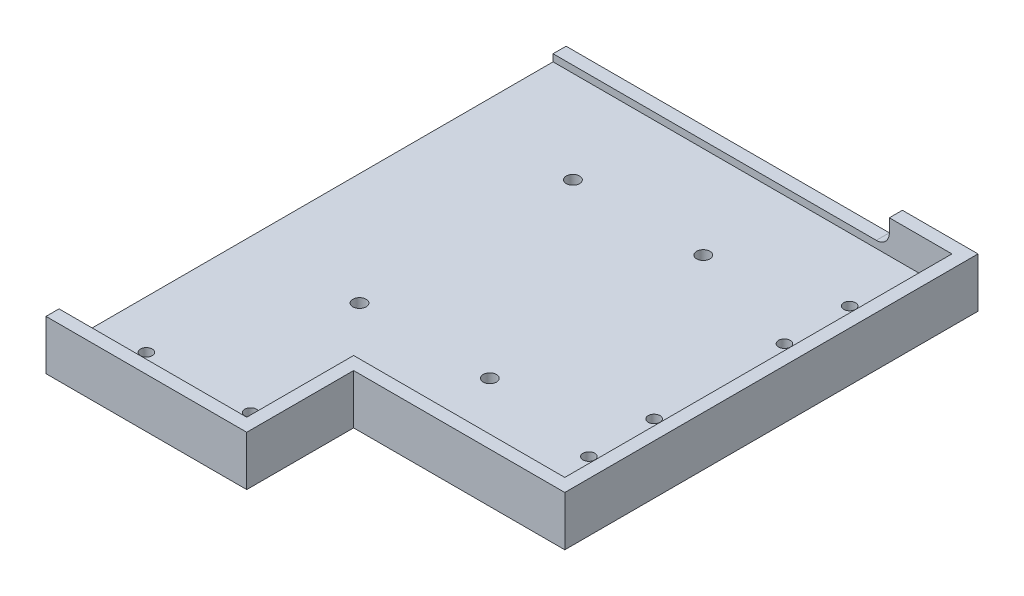
ISO-10303-21;
HEADER;
FILE_DESCRIPTION(('STEP AP214'),'2;1');
FILE_NAME('part.step','',(''),(''),'','','');
FILE_SCHEMA(('AUTOMOTIVE_DESIGN { 1 0 10303 214 1 1 1 1 }'));
ENDSEC;
DATA;
#1=APPLICATION_CONTEXT('core data for automotive mechanical design processes');
#2=APPLICATION_PROTOCOL_DEFINITION('international standard','automotive_design',2000,#1);
#3=PRODUCT_CONTEXT('',#1,'mechanical');
#4=PRODUCT('Part','Part','',(#3));
#5=PRODUCT_RELATED_PRODUCT_CATEGORY('part','',(#4));
#6=PRODUCT_DEFINITION_FORMATION('','',#4);
#7=PRODUCT_DEFINITION_CONTEXT('part definition',#1,'design');
#8=PRODUCT_DEFINITION('design','',#6,#7);
#9=PRODUCT_DEFINITION_SHAPE('','',#8);
#10=(LENGTH_UNIT() NAMED_UNIT(*) SI_UNIT(.MILLI.,.METRE.));
#11=(NAMED_UNIT(*) PLANE_ANGLE_UNIT() SI_UNIT($,.RADIAN.));
#12=(NAMED_UNIT(*) SI_UNIT($,.STERADIAN.) SOLID_ANGLE_UNIT());
#13=UNCERTAINTY_MEASURE_WITH_UNIT(LENGTH_MEASURE(1.E-05),#10,'distance_accuracy_value','');
#14=(GEOMETRIC_REPRESENTATION_CONTEXT(3) GLOBAL_UNCERTAINTY_ASSIGNED_CONTEXT((#13)) GLOBAL_UNIT_ASSIGNED_CONTEXT((#10,
#11,#12)) REPRESENTATION_CONTEXT('',''));
#15=CARTESIAN_POINT('',(0.,0.,0.));
#16=DIRECTION('',(0.,0.,1.));
#17=DIRECTION('',(1.,0.,0.));
#18=AXIS2_PLACEMENT_3D('',#15,#16,#17);
#19=CARTESIAN_POINT('',(0.,0.,0.));
#20=DIRECTION('',(0.,1.,0.));
#21=DIRECTION('',(0.,0.,1.));
#22=AXIS2_PLACEMENT_3D('',#19,#20,#21);
#23=PLANE('',#22);
#24=CARTESIAN_POINT('',(43.,0.,122.25));
#25=DIRECTION('',(0.,1.,0.));
#26=DIRECTION('',(0.,0.,1.));
#27=AXIS2_PLACEMENT_3D('',#24,#25,#26);
#28=CIRCLE('',#27,2.55);
#29=CARTESIAN_POINT('',(43.,0.,124.8));
#30=VERTEX_POINT('',#29);
#31=EDGE_CURVE('E721',#30,#30,#28,.T.);
#32=ORIENTED_EDGE('',*,*,#31,.T.);
#33=EDGE_LOOP('',(#32));
#34=FACE_BOUND('',#33,.T.);
#35=CARTESIAN_POINT('',(93.,0.,122.25));
#36=DIRECTION('',(0.,1.,0.));
#37=DIRECTION('',(0.,0.,1.));
#38=AXIS2_PLACEMENT_3D('',#35,#36,#37);
#39=CIRCLE('',#38,2.55);
#40=CARTESIAN_POINT('',(93.,0.,124.8));
#41=VERTEX_POINT('',#40);
#42=EDGE_CURVE('E713',#41,#41,#39,.T.);
#43=ORIENTED_EDGE('',*,*,#42,.T.);
#44=EDGE_LOOP('',(#43));
#45=FACE_BOUND('',#44,.T.);
#46=CARTESIAN_POINT('',(93.,0.,40.38));
#47=DIRECTION('',(0.,1.,0.));
#48=DIRECTION('',(0.,0.,1.));
#49=AXIS2_PLACEMENT_3D('',#46,#47,#48);
#50=CIRCLE('',#49,2.55);
#51=CARTESIAN_POINT('',(93.,0.,42.93));
#52=VERTEX_POINT('',#51);
#53=EDGE_CURVE('E705',#52,#52,#50,.T.);
#54=ORIENTED_EDGE('',*,*,#53,.T.);
#55=EDGE_LOOP('',(#54));
#56=FACE_BOUND('',#55,.T.);
#57=CARTESIAN_POINT('',(43.,0.,40.38));
#58=DIRECTION('',(0.,1.,0.));
#59=DIRECTION('',(0.,0.,1.));
#60=AXIS2_PLACEMENT_3D('',#57,#58,#59);
#61=CIRCLE('',#60,2.55);
#62=CARTESIAN_POINT('',(43.,0.,42.93));
#63=VERTEX_POINT('',#62);
#64=EDGE_CURVE('E685',#63,#63,#61,.T.);
#65=ORIENTED_EDGE('',*,*,#64,.T.);
#66=EDGE_LOOP('',(#65));
#67=FACE_BOUND('',#66,.T.);
#68=CARTESIAN_POINT('',(138.,0.,129.25));
#69=DIRECTION('',(0.,-1.,0.));
#70=DIRECTION('',(0.,0.,-1.));
#71=AXIS2_PLACEMENT_3D('',#68,#69,#70);
#72=CIRCLE('',#71,2.25);
#73=CARTESIAN_POINT('',(138.,0.,127.));
#74=VERTEX_POINT('',#73);
#75=EDGE_CURVE('E280',#74,#74,#72,.T.);
#76=ORIENTED_EDGE('',*,*,#75,.F.);
#77=EDGE_LOOP('',(#76));
#78=FACE_BOUND('',#77,.T.);
#79=CARTESIAN_POINT('',(138.,0.,54.25));
#80=DIRECTION('',(0.,-1.,0.));
#81=DIRECTION('',(0.,0.,-1.));
#82=AXIS2_PLACEMENT_3D('',#79,#80,#81);
#83=CIRCLE('',#82,2.25);
#84=CARTESIAN_POINT('',(138.,0.,52.));
#85=VERTEX_POINT('',#84);
#86=EDGE_CURVE('E300',#85,#85,#83,.T.);
#87=ORIENTED_EDGE('',*,*,#86,.F.);
#88=EDGE_LOOP('',(#87));
#89=FACE_BOUND('',#88,.T.);
#90=DIRECTION('',(-1.,0.,0.));
#91=VECTOR('',#90,1.);
#92=CARTESIAN_POINT('',(158.,0.,158.5));
#93=LINE('',#92,#91);
#94=CARTESIAN_POINT('',(158.,0.,158.5));
#95=VERTEX_POINT('',#94);
#96=CARTESIAN_POINT('',(77.0000000000001,0.,158.5));
#97=VERTEX_POINT('',#96);
#98=EDGE_CURVE('E243',#95,#97,#93,.T.);
#99=ORIENTED_EDGE('',*,*,#98,.T.);
#100=DIRECTION('',(0.,0.,1.));
#101=VECTOR('',#100,1.);
#102=CARTESIAN_POINT('',(77.0000000000001,0.,199.5));
#103=LINE('',#102,#101);
#104=CARTESIAN_POINT('',(77.0000000000001,0.,199.5));
#105=VERTEX_POINT('',#104);
#106=EDGE_CURVE('E385',#97,#105,#103,.T.);
#107=ORIENTED_EDGE('',*,*,#106,.T.);
#108=DIRECTION('',(1.,0.,0.));
#109=VECTOR('',#108,1.);
#110=CARTESIAN_POINT('',(0.,0.,199.5));
#111=LINE('',#110,#109);
#112=CARTESIAN_POINT('',(0.,0.,199.5));
#113=VERTEX_POINT('',#112);
#114=EDGE_CURVE('E207',#113,#105,#111,.T.);
#115=ORIENTED_EDGE('',*,*,#114,.F.);
#116=DIRECTION('',(0.,0.,1.));
#117=VECTOR('',#116,1.);
#118=CARTESIAN_POINT('',(0.,0.,0.));
#119=LINE('',#118,#117);
#120=CARTESIAN_POINT('',(0.,0.,0.));
#121=VERTEX_POINT('',#120);
#122=EDGE_CURVE('E212',#121,#113,#119,.T.);
#123=ORIENTED_EDGE('',*,*,#122,.F.);
#124=DIRECTION('',(-1.,0.,0.));
#125=VECTOR('',#124,1.);
#126=CARTESIAN_POINT('',(0.,0.,0.));
#127=LINE('',#126,#125);
#128=CARTESIAN_POINT('',(158.,0.,0.));
#129=VERTEX_POINT('',#128);
#130=EDGE_CURVE('E175',#129,#121,#127,.T.);
#131=ORIENTED_EDGE('',*,*,#130,.F.);
#132=DIRECTION('',(0.,0.,-1.));
#133=VECTOR('',#132,1.);
#134=CARTESIAN_POINT('',(158.,0.,0.));
#135=LINE('',#134,#133);
#136=EDGE_CURVE('E220',#95,#129,#135,.T.);
#137=ORIENTED_EDGE('',*,*,#136,.F.);
#138=EDGE_LOOP('',(#99,#107,#115,#123,#131,#137));
#139=FACE_BOUND('',#138,.T.);
#140=CARTESIAN_POINT('',(138.,0.,29.25));
#141=DIRECTION('',(0.,-1.,0.));
#142=DIRECTION('',(0.,0.,-1.));
#143=AXIS2_PLACEMENT_3D('',#140,#141,#142);
#144=CIRCLE('',#143,2.25);
#145=CARTESIAN_POINT('',(138.,0.,27.));
#146=VERTEX_POINT('',#145);
#147=EDGE_CURVE('E250',#146,#146,#144,.T.);
#148=ORIENTED_EDGE('',*,*,#147,.F.);
#149=EDGE_LOOP('',(#148));
#150=FACE_BOUND('',#149,.T.);
#151=CARTESIAN_POINT('',(138.,0.,104.25));
#152=DIRECTION('',(0.,-1.,0.));
#153=DIRECTION('',(0.,0.,-1.));
#154=AXIS2_PLACEMENT_3D('',#151,#152,#153);
#155=CIRCLE('',#154,2.25);
#156=CARTESIAN_POINT('',(138.,0.,102.));
#157=VERTEX_POINT('',#156);
#158=EDGE_CURVE('E254',#157,#157,#155,.T.);
#159=ORIENTED_EDGE('',*,*,#158,.F.);
#160=EDGE_LOOP('',(#159));
#161=FACE_BOUND('',#160,.T.);
#162=CARTESIAN_POINT('',(58.5,0.,179.5));
#163=DIRECTION('',(0.,-1.,0.));
#164=DIRECTION('',(0.,0.,-1.));
#165=AXIS2_PLACEMENT_3D('',#162,#163,#164);
#166=CIRCLE('',#165,2.25);
#167=CARTESIAN_POINT('',(58.5,0.,177.25));
#168=VERTEX_POINT('',#167);
#169=EDGE_CURVE('E258',#168,#168,#166,.T.);
#170=ORIENTED_EDGE('',*,*,#169,.F.);
#171=EDGE_LOOP('',(#170));
#172=FACE_BOUND('',#171,.T.);
#173=CARTESIAN_POINT('',(18.5,0.,179.5));
#174=DIRECTION('',(0.,-1.,0.));
#175=DIRECTION('',(0.,0.,-1.));
#176=AXIS2_PLACEMENT_3D('',#173,#174,#175);
#177=CIRCLE('',#176,2.25);
#178=CARTESIAN_POINT('',(18.5,0.,177.25));
#179=VERTEX_POINT('',#178);
#180=EDGE_CURVE('E261',#179,#179,#177,.T.);
#181=ORIENTED_EDGE('',*,*,#180,.F.);
#182=EDGE_LOOP('',(#181));
#183=FACE_BOUND('',#182,.T.);
#184=ADVANCED_FACE('F43',(#34,#45,#56,#67,#78,#89,#139,#150,#161,#172,#183),#23,.F.);
#185=CARTESIAN_POINT('',(0.,6.35,0.));
#186=DIRECTION('',(1.,0.,0.));
#187=DIRECTION('',(0.,0.,-1.));
#188=AXIS2_PLACEMENT_3D('',#185,#186,#187);
#189=PLANE('',#188);
#190=DIRECTION('',(0.,-1.,0.));
#191=VECTOR('',#190,1.);
#192=CARTESIAN_POINT('',(0.,19.05,5.00000000000002));
#193=LINE('',#192,#191);
#194=CARTESIAN_POINT('',(0.,9.05,5.00000000000003));
#195=VERTEX_POINT('',#194);
#196=CARTESIAN_POINT('',(0.,6.35,5.00000000000002));
#197=VERTEX_POINT('',#196);
#198=EDGE_CURVE('E168',#195,#197,#193,.T.);
#199=ORIENTED_EDGE('',*,*,#198,.F.);
#200=DIRECTION('',(0.,0.,-1.));
#201=VECTOR('',#200,1.);
#202=CARTESIAN_POINT('',(0.,9.05,199.501));
#203=LINE('',#202,#201);
#204=CARTESIAN_POINT('',(0.,9.05,0.));
#205=VERTEX_POINT('',#204);
#206=EDGE_CURVE('E153',#195,#205,#203,.T.);
#207=ORIENTED_EDGE('',*,*,#206,.T.);
#208=DIRECTION('',(0.,-1.,0.));
#209=VECTOR('',#208,1.);
#210=CARTESIAN_POINT('',(0.,6.35,0.));
#211=LINE('',#210,#209);
#212=EDGE_CURVE('E165',#205,#121,#211,.T.);
#213=ORIENTED_EDGE('',*,*,#212,.T.);
#214=ORIENTED_EDGE('',*,*,#122,.T.);
#215=DIRECTION('',(0.,-1.,0.));
#216=VECTOR('',#215,1.);
#217=CARTESIAN_POINT('',(0.,6.35,199.5));
#218=LINE('',#217,#216);
#219=CARTESIAN_POINT('',(0.,19.05,199.5));
#220=VERTEX_POINT('',#219);
#221=EDGE_CURVE('E184',#220,#113,#218,.T.);
#222=ORIENTED_EDGE('',*,*,#221,.F.);
#223=DIRECTION('',(0.,0.,1.));
#224=VECTOR('',#223,1.);
#225=CARTESIAN_POINT('',(0.,19.05,194.5));
#226=LINE('',#225,#224);
#227=CARTESIAN_POINT('',(0.,19.05,194.5));
#228=VERTEX_POINT('',#227);
#229=EDGE_CURVE('E327',#228,#220,#226,.T.);
#230=ORIENTED_EDGE('',*,*,#229,.F.);
#231=DIRECTION('',(0.,-1.,0.));
#232=VECTOR('',#231,1.);
#233=CARTESIAN_POINT('',(0.,19.05,194.5));
#234=LINE('',#233,#232);
#235=CARTESIAN_POINT('',(0.,6.35,194.5));
#236=VERTEX_POINT('',#235);
#237=EDGE_CURVE('E343',#228,#236,#234,.T.);
#238=ORIENTED_EDGE('',*,*,#237,.T.);
#239=DIRECTION('',(0.,0.,1.));
#240=VECTOR('',#239,1.);
#241=CARTESIAN_POINT('',(0.,6.35,0.));
#242=LINE('',#241,#240);
#243=EDGE_CURVE('E179',#197,#236,#242,.T.);
#244=ORIENTED_EDGE('',*,*,#243,.F.);
#245=EDGE_LOOP('',(#199,#207,#213,#214,#222,#230,#238,#244));
#246=FACE_BOUND('',#245,.T.);
#247=ADVANCED_FACE('F163',(#246),#189,.F.);
#248=CARTESIAN_POINT('',(0.,6.35,199.5));
#249=DIRECTION('',(0.,0.,-1.));
#250=DIRECTION('',(-1.,0.,0.));
#251=AXIS2_PLACEMENT_3D('',#248,#249,#250);
#252=PLANE('',#251);
#253=ORIENTED_EDGE('',*,*,#114,.T.);
#254=DIRECTION('',(0.,1.,0.));
#255=VECTOR('',#254,1.);
#256=CARTESIAN_POINT('',(77.0000000000001,0.,199.5));
#257=LINE('',#256,#255);
#258=CARTESIAN_POINT('',(77.0000000000001,19.05,199.5));
#259=VERTEX_POINT('',#258);
#260=EDGE_CURVE('E215',#105,#259,#257,.T.);
#261=ORIENTED_EDGE('',*,*,#260,.T.);
#262=DIRECTION('',(1.,0.,0.));
#263=VECTOR('',#262,1.);
#264=CARTESIAN_POINT('',(0.,19.05,199.5));
#265=LINE('',#264,#263);
#266=EDGE_CURVE('E209',#220,#259,#265,.T.);
#267=ORIENTED_EDGE('',*,*,#266,.F.);
#268=ORIENTED_EDGE('',*,*,#221,.T.);
#269=EDGE_LOOP('',(#253,#261,#267,#268));
#270=FACE_BOUND('',#269,.T.);
#271=ADVANCED_FACE('F206',(#270),#252,.F.);
#272=CARTESIAN_POINT('',(158.,6.35,0.));
#273=DIRECTION('',(-1.,0.,0.));
#274=DIRECTION('',(0.,0.,1.));
#275=AXIS2_PLACEMENT_3D('',#272,#273,#274);
#276=PLANE('',#275);
#277=DIRECTION('',(0.,-1.,0.));
#278=VECTOR('',#277,1.);
#279=CARTESIAN_POINT('',(158.,6.35,0.));
#280=LINE('',#279,#278);
#281=CARTESIAN_POINT('',(158.,19.05,0.));
#282=VERTEX_POINT('',#281);
#283=EDGE_CURVE('E178',#282,#129,#280,.T.);
#284=ORIENTED_EDGE('',*,*,#283,.F.);
#285=DIRECTION('',(0.,0.,-1.));
#286=VECTOR('',#285,1.);
#287=CARTESIAN_POINT('',(158.,19.05,158.5));
#288=LINE('',#287,#286);
#289=CARTESIAN_POINT('',(158.,19.05,158.5));
#290=VERTEX_POINT('',#289);
#291=EDGE_CURVE('E340',#290,#282,#288,.T.);
#292=ORIENTED_EDGE('',*,*,#291,.F.);
#293=DIRECTION('',(0.,1.,0.));
#294=VECTOR('',#293,1.);
#295=CARTESIAN_POINT('',(158.,0.,158.5));
#296=LINE('',#295,#294);
#297=EDGE_CURVE('E236',#95,#290,#296,.T.);
#298=ORIENTED_EDGE('',*,*,#297,.F.);
#299=ORIENTED_EDGE('',*,*,#136,.T.);
#300=EDGE_LOOP('',(#284,#292,#298,#299));
#301=FACE_BOUND('',#300,.T.);
#302=ADVANCED_FACE('F233',(#301),#276,.F.);
#303=CARTESIAN_POINT('',(0.,6.35,0.));
#304=DIRECTION('',(0.,0.,1.));
#305=DIRECTION('',(1.,0.,0.));
#306=AXIS2_PLACEMENT_3D('',#303,#304,#305);
#307=PLANE('',#306);
#308=DIRECTION('',(-1.,0.,0.));
#309=VECTOR('',#308,1.);
#310=CARTESIAN_POINT('',(129.,9.04999999999999,0.));
#311=LINE('',#310,#309);
#312=CARTESIAN_POINT('',(124.,9.04999999999999,0.));
#313=VERTEX_POINT('',#312);
#314=EDGE_CURVE('E149',#313,#205,#311,.T.);
#315=ORIENTED_EDGE('',*,*,#314,.F.);
#316=CARTESIAN_POINT('',(124.,14.05,0.));
#317=DIRECTION('',(0.,0.,1.));
#318=DIRECTION('',(1.,0.,0.));
#319=AXIS2_PLACEMENT_3D('',#316,#317,#318);
#320=CIRCLE('',#319,5.);
#321=CARTESIAN_POINT('',(129.,14.05,0.));
#322=VERTEX_POINT('',#321);
#323=EDGE_CURVE('E52',#313,#322,#320,.T.);
#324=ORIENTED_EDGE('',*,*,#323,.T.);
#325=DIRECTION('',(0.,-1.,0.));
#326=VECTOR('',#325,1.);
#327=CARTESIAN_POINT('',(129.,19.05,0.));
#328=LINE('',#327,#326);
#329=CARTESIAN_POINT('',(129.,19.05,0.));
#330=VERTEX_POINT('',#329);
#331=EDGE_CURVE('E159',#330,#322,#328,.T.);
#332=ORIENTED_EDGE('',*,*,#331,.F.);
#333=DIRECTION('',(-1.,0.,0.));
#334=VECTOR('',#333,1.);
#335=CARTESIAN_POINT('',(158.,19.05,0.));
#336=LINE('',#335,#334);
#337=EDGE_CURVE('E240',#282,#330,#336,.T.);
#338=ORIENTED_EDGE('',*,*,#337,.F.);
#339=ORIENTED_EDGE('',*,*,#283,.T.);
#340=ORIENTED_EDGE('',*,*,#130,.T.);
#341=ORIENTED_EDGE('',*,*,#212,.F.);
#342=EDGE_LOOP('',(#315,#324,#332,#338,#339,#340,#341));
#343=FACE_BOUND('',#342,.T.);
#344=ADVANCED_FACE('F172',(#343),#307,.F.);
#345=CARTESIAN_POINT('',(0.,6.35,0.));
#346=DIRECTION('',(0.,1.,0.));
#347=DIRECTION('',(0.,0.,1.));
#348=AXIS2_PLACEMENT_3D('',#345,#346,#347);
#349=PLANE('',#348);
#350=CARTESIAN_POINT('',(43.,6.35,122.25));
#351=DIRECTION('',(0.,1.,0.));
#352=DIRECTION('',(0.,0.,1.));
#353=AXIS2_PLACEMENT_3D('',#350,#351,#352);
#354=CIRCLE('',#353,2.55);
#355=CARTESIAN_POINT('',(43.,6.35,124.8));
#356=VERTEX_POINT('',#355);
#357=EDGE_CURVE('E725',#356,#356,#354,.T.);
#358=ORIENTED_EDGE('',*,*,#357,.F.);
#359=EDGE_LOOP('',(#358));
#360=FACE_BOUND('',#359,.T.);
#361=CARTESIAN_POINT('',(93.,6.35,122.25));
#362=DIRECTION('',(0.,1.,0.));
#363=DIRECTION('',(0.,0.,1.));
#364=AXIS2_PLACEMENT_3D('',#361,#362,#363);
#365=CIRCLE('',#364,2.55);
#366=CARTESIAN_POINT('',(93.,6.35,124.8));
#367=VERTEX_POINT('',#366);
#368=EDGE_CURVE('E717',#367,#367,#365,.T.);
#369=ORIENTED_EDGE('',*,*,#368,.F.);
#370=EDGE_LOOP('',(#369));
#371=FACE_BOUND('',#370,.T.);
#372=CARTESIAN_POINT('',(93.,6.35,40.38));
#373=DIRECTION('',(0.,1.,0.));
#374=DIRECTION('',(0.,0.,1.));
#375=AXIS2_PLACEMENT_3D('',#372,#373,#374);
#376=CIRCLE('',#375,2.55);
#377=CARTESIAN_POINT('',(93.,6.35,42.93));
#378=VERTEX_POINT('',#377);
#379=EDGE_CURVE('E709',#378,#378,#376,.T.);
#380=ORIENTED_EDGE('',*,*,#379,.F.);
#381=EDGE_LOOP('',(#380));
#382=FACE_BOUND('',#381,.T.);
#383=CARTESIAN_POINT('',(43.,6.35,40.38));
#384=DIRECTION('',(0.,1.,0.));
#385=DIRECTION('',(0.,0.,1.));
#386=AXIS2_PLACEMENT_3D('',#383,#384,#385);
#387=CIRCLE('',#386,2.55);
#388=CARTESIAN_POINT('',(43.,6.35,42.93));
#389=VERTEX_POINT('',#388);
#390=EDGE_CURVE('E692',#389,#389,#387,.T.);
#391=ORIENTED_EDGE('',*,*,#390,.F.);
#392=EDGE_LOOP('',(#391));
#393=FACE_BOUND('',#392,.T.);
#394=CARTESIAN_POINT('',(18.5,6.35,179.5));
#395=DIRECTION('',(0.,1.,0.));
#396=DIRECTION('',(0.,0.,1.));
#397=AXIS2_PLACEMENT_3D('',#394,#395,#396);
#398=CIRCLE('',#397,2.25);
#399=CARTESIAN_POINT('',(18.5,6.35,181.75));
#400=VERTEX_POINT('',#399);
#401=EDGE_CURVE('E264',#400,#400,#398,.T.);
#402=ORIENTED_EDGE('',*,*,#401,.F.);
#403=EDGE_LOOP('',(#402));
#404=FACE_BOUND('',#403,.T.);
#405=CARTESIAN_POINT('',(58.5,6.35,179.5));
#406=DIRECTION('',(0.,1.,0.));
#407=DIRECTION('',(0.,0.,1.));
#408=AXIS2_PLACEMENT_3D('',#405,#406,#407);
#409=CIRCLE('',#408,2.25);
#410=CARTESIAN_POINT('',(58.5,6.35,181.75));
#411=VERTEX_POINT('',#410);
#412=EDGE_CURVE('E276',#411,#411,#409,.T.);
#413=ORIENTED_EDGE('',*,*,#412,.F.);
#414=EDGE_LOOP('',(#413));
#415=FACE_BOUND('',#414,.T.);
#416=CARTESIAN_POINT('',(138.,6.35,129.25));
#417=DIRECTION('',(0.,1.,0.));
#418=DIRECTION('',(0.,0.,1.));
#419=AXIS2_PLACEMENT_3D('',#416,#417,#418);
#420=CIRCLE('',#419,2.25);
#421=CARTESIAN_POINT('',(138.,6.35,131.5));
#422=VERTEX_POINT('',#421);
#423=EDGE_CURVE('E284',#422,#422,#420,.T.);
#424=ORIENTED_EDGE('',*,*,#423,.F.);
#425=EDGE_LOOP('',(#424));
#426=FACE_BOUND('',#425,.T.);
#427=CARTESIAN_POINT('',(138.,6.35,104.25));
#428=DIRECTION('',(0.,1.,0.));
#429=DIRECTION('',(0.,0.,1.));
#430=AXIS2_PLACEMENT_3D('',#427,#428,#429);
#431=CIRCLE('',#430,2.25);
#432=CARTESIAN_POINT('',(138.,6.35,106.5));
#433=VERTEX_POINT('',#432);
#434=EDGE_CURVE('E290',#433,#433,#431,.T.);
#435=ORIENTED_EDGE('',*,*,#434,.F.);
#436=EDGE_LOOP('',(#435));
#437=FACE_BOUND('',#436,.T.);
#438=CARTESIAN_POINT('',(138.,6.35,29.25));
#439=DIRECTION('',(0.,1.,0.));
#440=DIRECTION('',(0.,0.,1.));
#441=AXIS2_PLACEMENT_3D('',#438,#439,#440);
#442=CIRCLE('',#441,2.25);
#443=CARTESIAN_POINT('',(138.,6.35,31.5));
#444=VERTEX_POINT('',#443);
#445=EDGE_CURVE('E296',#444,#444,#442,.T.);
#446=ORIENTED_EDGE('',*,*,#445,.F.);
#447=EDGE_LOOP('',(#446));
#448=FACE_BOUND('',#447,.T.);
#449=CARTESIAN_POINT('',(138.,6.35,54.25));
#450=DIRECTION('',(0.,1.,0.));
#451=DIRECTION('',(0.,0.,1.));
#452=AXIS2_PLACEMENT_3D('',#449,#450,#451);
#453=CIRCLE('',#452,2.25);
#454=CARTESIAN_POINT('',(138.,6.35,56.5));
#455=VERTEX_POINT('',#454);
#456=EDGE_CURVE('E304',#455,#455,#453,.T.);
#457=ORIENTED_EDGE('',*,*,#456,.F.);
#458=EDGE_LOOP('',(#457));
#459=FACE_BOUND('',#458,.T.);
#460=DIRECTION('',(-1.,0.,0.));
#461=VECTOR('',#460,1.);
#462=CARTESIAN_POINT('',(0.,6.35,194.5));
#463=LINE('',#462,#461);
#464=CARTESIAN_POINT('',(72.0000000000001,6.35,194.5));
#465=VERTEX_POINT('',#464);
#466=EDGE_CURVE('E312',#465,#236,#463,.T.);
#467=ORIENTED_EDGE('',*,*,#466,.F.);
#468=DIRECTION('',(0.,0.,1.));
#469=VECTOR('',#468,1.);
#470=CARTESIAN_POINT('',(72.0000000000001,6.35,153.5));
#471=LINE('',#470,#469);
#472=CARTESIAN_POINT('',(72.0000000000001,6.35,153.5));
#473=VERTEX_POINT('',#472);
#474=EDGE_CURVE('E355',#473,#465,#471,.T.);
#475=ORIENTED_EDGE('',*,*,#474,.F.);
#476=DIRECTION('',(-1.,0.,0.));
#477=VECTOR('',#476,1.);
#478=CARTESIAN_POINT('',(153.,6.35,153.5));
#479=LINE('',#478,#477);
#480=CARTESIAN_POINT('',(153.,6.35,153.5));
#481=VERTEX_POINT('',#480);
#482=EDGE_CURVE('E351',#481,#473,#479,.T.);
#483=ORIENTED_EDGE('',*,*,#482,.F.);
#484=DIRECTION('',(0.,0.,1.));
#485=VECTOR('',#484,1.);
#486=CARTESIAN_POINT('',(153.,6.35,5.00000000000002));
#487=LINE('',#486,#485);
#488=CARTESIAN_POINT('',(153.,6.35,5.00000000000002));
#489=VERTEX_POINT('',#488);
#490=EDGE_CURVE('E347',#489,#481,#487,.T.);
#491=ORIENTED_EDGE('',*,*,#490,.F.);
#492=DIRECTION('',(1.,0.,0.));
#493=VECTOR('',#492,1.);
#494=CARTESIAN_POINT('',(0.,6.35,5.00000000000002));
#495=LINE('',#494,#493);
#496=EDGE_CURVE('E308',#197,#489,#495,.T.);
#497=ORIENTED_EDGE('',*,*,#496,.F.);
#498=ORIENTED_EDGE('',*,*,#243,.T.);
#499=EDGE_LOOP('',(#467,#475,#483,#491,#497,#498));
#500=FACE_BOUND('',#499,.T.);
#501=ADVANCED_FACE('F402',(#360,#371,#382,#393,#404,#415,#426,#437,#448,#459,#500),#349,.T.);
#502=CARTESIAN_POINT('',(77.0000000000001,0.,199.5));
#503=DIRECTION('',(-1.,0.,0.));
#504=DIRECTION('',(0.,0.,1.));
#505=AXIS2_PLACEMENT_3D('',#502,#503,#504);
#506=PLANE('',#505);
#507=DIRECTION('',(0.,1.,0.));
#508=VECTOR('',#507,1.);
#509=CARTESIAN_POINT('',(77.0000000000001,0.,158.5));
#510=LINE('',#509,#508);
#511=CARTESIAN_POINT('',(77.0000000000001,19.05,158.5));
#512=VERTEX_POINT('',#511);
#513=EDGE_CURVE('E222',#97,#512,#510,.T.);
#514=ORIENTED_EDGE('',*,*,#513,.T.);
#515=DIRECTION('',(0.,0.,-1.));
#516=VECTOR('',#515,1.);
#517=CARTESIAN_POINT('',(77.0000000000001,19.05,158.5));
#518=LINE('',#517,#516);
#519=EDGE_CURVE('E332',#259,#512,#518,.T.);
#520=ORIENTED_EDGE('',*,*,#519,.F.);
#521=ORIENTED_EDGE('',*,*,#260,.F.);
#522=ORIENTED_EDGE('',*,*,#106,.F.);
#523=EDGE_LOOP('',(#514,#520,#521,#522));
#524=FACE_BOUND('',#523,.T.);
#525=ADVANCED_FACE('F400',(#524),#506,.F.);
#526=CARTESIAN_POINT('',(158.,0.,158.5));
#527=DIRECTION('',(0.,0.,-1.));
#528=DIRECTION('',(-1.,0.,0.));
#529=AXIS2_PLACEMENT_3D('',#526,#527,#528);
#530=PLANE('',#529);
#531=ORIENTED_EDGE('',*,*,#297,.T.);
#532=DIRECTION('',(1.,0.,0.));
#533=VECTOR('',#532,1.);
#534=CARTESIAN_POINT('',(158.,19.05,158.5));
#535=LINE('',#534,#533);
#536=EDGE_CURVE('E336',#512,#290,#535,.T.);
#537=ORIENTED_EDGE('',*,*,#536,.F.);
#538=ORIENTED_EDGE('',*,*,#513,.F.);
#539=ORIENTED_EDGE('',*,*,#98,.F.);
#540=EDGE_LOOP('',(#531,#537,#538,#539));
#541=FACE_BOUND('',#540,.T.);
#542=ADVANCED_FACE('F393',(#541),#530,.F.);
#543=CARTESIAN_POINT('',(0.,19.05,5.00000000000002));
#544=DIRECTION('',(0.,0.,-1.));
#545=DIRECTION('',(-1.,0.,0.));
#546=AXIS2_PLACEMENT_3D('',#543,#544,#545);
#547=PLANE('',#546);
#548=DIRECTION('',(1.,0.,0.));
#549=VECTOR('',#548,1.);
#550=CARTESIAN_POINT('',(0.,19.05,5.00000000000002));
#551=LINE('',#550,#549);
#552=CARTESIAN_POINT('',(129.,19.05,5.00000000000002));
#553=VERTEX_POINT('',#552);
#554=CARTESIAN_POINT('',(153.,19.05,5.00000000000002));
#555=VERTEX_POINT('',#554);
#556=EDGE_CURVE('E311',#553,#555,#551,.T.);
#557=ORIENTED_EDGE('',*,*,#556,.F.);
#558=DIRECTION('',(0.,1.,0.));
#559=VECTOR('',#558,1.);
#560=CARTESIAN_POINT('',(129.,19.05,5.00000000000003));
#561=LINE('',#560,#559);
#562=CARTESIAN_POINT('',(129.,14.05,5.00000000000003));
#563=VERTEX_POINT('',#562);
#564=EDGE_CURVE('E683',#563,#553,#561,.T.);
#565=ORIENTED_EDGE('',*,*,#564,.F.);
#566=CARTESIAN_POINT('',(124.,14.05,5.00000000000003));
#567=DIRECTION('',(0.,0.,-1.));
#568=DIRECTION('',(-1.,0.,0.));
#569=AXIS2_PLACEMENT_3D('',#566,#567,#568);
#570=CIRCLE('',#569,5.);
#571=CARTESIAN_POINT('',(124.,9.04999999999999,5.00000000000003));
#572=VERTEX_POINT('',#571);
#573=EDGE_CURVE('E11',#563,#572,#570,.T.);
#574=ORIENTED_EDGE('',*,*,#573,.T.);
#575=DIRECTION('',(1.,0.,0.));
#576=VECTOR('',#575,1.);
#577=CARTESIAN_POINT('',(129.,9.04999999999999,5.00000000000003));
#578=LINE('',#577,#576);
#579=EDGE_CURVE('E265',#195,#572,#578,.T.);
#580=ORIENTED_EDGE('',*,*,#579,.F.);
#581=ORIENTED_EDGE('',*,*,#198,.T.);
#582=ORIENTED_EDGE('',*,*,#496,.T.);
#583=DIRECTION('',(0.,-1.,0.));
#584=VECTOR('',#583,1.);
#585=CARTESIAN_POINT('',(153.,19.05,5.00000000000002));
#586=LINE('',#585,#584);
#587=EDGE_CURVE('E377',#555,#489,#586,.T.);
#588=ORIENTED_EDGE('',*,*,#587,.F.);
#589=EDGE_LOOP('',(#557,#565,#574,#580,#581,#582,#588));
#590=FACE_BOUND('',#589,.T.);
#591=ADVANCED_FACE('F408',(#590),#547,.F.);
#592=CARTESIAN_POINT('',(153.,19.05,5.00000000000002));
#593=DIRECTION('',(1.,0.,0.));
#594=DIRECTION('',(0.,0.,-1.));
#595=AXIS2_PLACEMENT_3D('',#592,#593,#594);
#596=PLANE('',#595);
#597=ORIENTED_EDGE('',*,*,#490,.T.);
#598=DIRECTION('',(0.,-1.,0.));
#599=VECTOR('',#598,1.);
#600=CARTESIAN_POINT('',(153.,19.05,153.5));
#601=LINE('',#600,#599);
#602=CARTESIAN_POINT('',(153.,19.05,153.5));
#603=VERTEX_POINT('',#602);
#604=EDGE_CURVE('E373',#603,#481,#601,.T.);
#605=ORIENTED_EDGE('',*,*,#604,.F.);
#606=DIRECTION('',(0.,0.,1.));
#607=VECTOR('',#606,1.);
#608=CARTESIAN_POINT('',(153.,19.05,5.00000000000002));
#609=LINE('',#608,#607);
#610=EDGE_CURVE('E315',#555,#603,#609,.T.);
#611=ORIENTED_EDGE('',*,*,#610,.F.);
#612=ORIENTED_EDGE('',*,*,#587,.T.);
#613=EDGE_LOOP('',(#597,#605,#611,#612));
#614=FACE_BOUND('',#613,.T.);
#615=ADVANCED_FACE('F453',(#614),#596,.F.);
#616=CARTESIAN_POINT('',(153.,19.05,153.5));
#617=DIRECTION('',(0.,0.,1.));
#618=DIRECTION('',(1.,0.,0.));
#619=AXIS2_PLACEMENT_3D('',#616,#617,#618);
#620=PLANE('',#619);
#621=ORIENTED_EDGE('',*,*,#482,.T.);
#622=DIRECTION('',(0.,-1.,0.));
#623=VECTOR('',#622,1.);
#624=CARTESIAN_POINT('',(72.0000000000001,19.05,153.5));
#625=LINE('',#624,#623);
#626=CARTESIAN_POINT('',(72.0000000000001,19.05,153.5));
#627=VERTEX_POINT('',#626);
#628=EDGE_CURVE('E369',#627,#473,#625,.T.);
#629=ORIENTED_EDGE('',*,*,#628,.F.);
#630=DIRECTION('',(-1.,0.,0.));
#631=VECTOR('',#630,1.);
#632=CARTESIAN_POINT('',(153.,19.05,153.5));
#633=LINE('',#632,#631);
#634=EDGE_CURVE('E318',#603,#627,#633,.T.);
#635=ORIENTED_EDGE('',*,*,#634,.F.);
#636=ORIENTED_EDGE('',*,*,#604,.T.);
#637=EDGE_LOOP('',(#621,#629,#635,#636));
#638=FACE_BOUND('',#637,.T.);
#639=ADVANCED_FACE('F597',(#638),#620,.F.);
#640=CARTESIAN_POINT('',(72.0000000000001,19.05,153.5));
#641=DIRECTION('',(1.,0.,0.));
#642=DIRECTION('',(0.,0.,-1.));
#643=AXIS2_PLACEMENT_3D('',#640,#641,#642);
#644=PLANE('',#643);
#645=ORIENTED_EDGE('',*,*,#474,.T.);
#646=DIRECTION('',(0.,-1.,0.));
#647=VECTOR('',#646,1.);
#648=CARTESIAN_POINT('',(72.0000000000001,19.05,194.5));
#649=LINE('',#648,#647);
#650=CARTESIAN_POINT('',(72.0000000000001,19.05,194.5));
#651=VERTEX_POINT('',#650);
#652=EDGE_CURVE('E365',#651,#465,#649,.T.);
#653=ORIENTED_EDGE('',*,*,#652,.F.);
#654=DIRECTION('',(0.,0.,1.));
#655=VECTOR('',#654,1.);
#656=CARTESIAN_POINT('',(72.0000000000001,19.05,153.5));
#657=LINE('',#656,#655);
#658=EDGE_CURVE('E321',#627,#651,#657,.T.);
#659=ORIENTED_EDGE('',*,*,#658,.F.);
#660=ORIENTED_EDGE('',*,*,#628,.T.);
#661=EDGE_LOOP('',(#645,#653,#659,#660));
#662=FACE_BOUND('',#661,.T.);
#663=ADVANCED_FACE('F588',(#662),#644,.F.);
#664=CARTESIAN_POINT('',(0.,19.05,194.5));
#665=DIRECTION('',(0.,0.,1.));
#666=DIRECTION('',(1.,0.,0.));
#667=AXIS2_PLACEMENT_3D('',#664,#665,#666);
#668=PLANE('',#667);
#669=ORIENTED_EDGE('',*,*,#466,.T.);
#670=ORIENTED_EDGE('',*,*,#237,.F.);
#671=DIRECTION('',(-1.,0.,0.));
#672=VECTOR('',#671,1.);
#673=CARTESIAN_POINT('',(0.,19.05,194.5));
#674=LINE('',#673,#672);
#675=EDGE_CURVE('E324',#651,#228,#674,.T.);
#676=ORIENTED_EDGE('',*,*,#675,.F.);
#677=ORIENTED_EDGE('',*,*,#652,.T.);
#678=EDGE_LOOP('',(#669,#670,#676,#677));
#679=FACE_BOUND('',#678,.T.);
#680=ADVANCED_FACE('F436',(#679),#668,.F.);
#681=CARTESIAN_POINT('',(0.,19.05,0.));
#682=DIRECTION('',(0.,1.,0.));
#683=DIRECTION('',(0.,0.,1.));
#684=AXIS2_PLACEMENT_3D('',#681,#682,#683);
#685=PLANE('',#684);
#686=DIRECTION('',(0.,0.,-1.));
#687=VECTOR('',#686,1.);
#688=CARTESIAN_POINT('',(129.,19.05,199.501));
#689=LINE('',#688,#687);
#690=EDGE_CURVE('E170',#553,#330,#689,.T.);
#691=ORIENTED_EDGE('',*,*,#690,.F.);
#692=ORIENTED_EDGE('',*,*,#556,.T.);
#693=ORIENTED_EDGE('',*,*,#610,.T.);
#694=ORIENTED_EDGE('',*,*,#634,.T.);
#695=ORIENTED_EDGE('',*,*,#658,.T.);
#696=ORIENTED_EDGE('',*,*,#675,.T.);
#697=ORIENTED_EDGE('',*,*,#229,.T.);
#698=ORIENTED_EDGE('',*,*,#266,.T.);
#699=ORIENTED_EDGE('',*,*,#519,.T.);
#700=ORIENTED_EDGE('',*,*,#536,.T.);
#701=ORIENTED_EDGE('',*,*,#291,.T.);
#702=ORIENTED_EDGE('',*,*,#337,.T.);
#703=EDGE_LOOP('',(#691,#692,#693,#694,#695,#696,#697,#698,#699,#700,#701,#702));
#704=FACE_BOUND('',#703,.T.);
#705=ADVANCED_FACE('F397',(#704),#685,.T.);
#706=CARTESIAN_POINT('',(138.,0.,54.25));
#707=DIRECTION('',(0.,-1.,0.));
#708=DIRECTION('',(0.,0.,-1.));
#709=AXIS2_PLACEMENT_3D('',#706,#707,#708);
#710=CYLINDRICAL_SURFACE('',#709,2.25);
#711=ORIENTED_EDGE('',*,*,#86,.T.);
#712=EDGE_LOOP('',(#711));
#713=FACE_BOUND('',#712,.T.);
#714=ORIENTED_EDGE('',*,*,#456,.T.);
#715=EDGE_LOOP('',(#714));
#716=FACE_BOUND('',#715,.T.);
#717=ADVANCED_FACE('F435',(#713,#716),#710,.F.);
#718=CARTESIAN_POINT('',(138.,0.,29.25));
#719=DIRECTION('',(0.,-1.,0.));
#720=DIRECTION('',(0.,0.,-1.));
#721=AXIS2_PLACEMENT_3D('',#718,#719,#720);
#722=CYLINDRICAL_SURFACE('',#721,2.25);
#723=ORIENTED_EDGE('',*,*,#147,.T.);
#724=EDGE_LOOP('',(#723));
#725=FACE_BOUND('',#724,.T.);
#726=ORIENTED_EDGE('',*,*,#445,.T.);
#727=EDGE_LOOP('',(#726));
#728=FACE_BOUND('',#727,.T.);
#729=ADVANCED_FACE('F563',(#725,#728),#722,.F.);
#730=CARTESIAN_POINT('',(138.,0.,104.25));
#731=DIRECTION('',(0.,-1.,0.));
#732=DIRECTION('',(0.,0.,-1.));
#733=AXIS2_PLACEMENT_3D('',#730,#731,#732);
#734=CYLINDRICAL_SURFACE('',#733,2.25);
#735=ORIENTED_EDGE('',*,*,#158,.T.);
#736=EDGE_LOOP('',(#735));
#737=FACE_BOUND('',#736,.T.);
#738=ORIENTED_EDGE('',*,*,#434,.T.);
#739=EDGE_LOOP('',(#738));
#740=FACE_BOUND('',#739,.T.);
#741=ADVANCED_FACE('F554',(#737,#740),#734,.F.);
#742=CARTESIAN_POINT('',(138.,0.,129.25));
#743=DIRECTION('',(0.,-1.,0.));
#744=DIRECTION('',(0.,0.,-1.));
#745=AXIS2_PLACEMENT_3D('',#742,#743,#744);
#746=CYLINDRICAL_SURFACE('',#745,2.25);
#747=ORIENTED_EDGE('',*,*,#75,.T.);
#748=EDGE_LOOP('',(#747));
#749=FACE_BOUND('',#748,.T.);
#750=ORIENTED_EDGE('',*,*,#423,.T.);
#751=EDGE_LOOP('',(#750));
#752=FACE_BOUND('',#751,.T.);
#753=ADVANCED_FACE('F545',(#749,#752),#746,.F.);
#754=CARTESIAN_POINT('',(58.5,0.,179.5));
#755=DIRECTION('',(0.,-1.,0.));
#756=DIRECTION('',(0.,0.,-1.));
#757=AXIS2_PLACEMENT_3D('',#754,#755,#756);
#758=CYLINDRICAL_SURFACE('',#757,2.25);
#759=ORIENTED_EDGE('',*,*,#169,.T.);
#760=EDGE_LOOP('',(#759));
#761=FACE_BOUND('',#760,.T.);
#762=ORIENTED_EDGE('',*,*,#412,.T.);
#763=EDGE_LOOP('',(#762));
#764=FACE_BOUND('',#763,.T.);
#765=ADVANCED_FACE('F538',(#761,#764),#758,.F.);
#766=CARTESIAN_POINT('',(18.5,0.,179.5));
#767=DIRECTION('',(0.,-1.,0.));
#768=DIRECTION('',(0.,0.,-1.));
#769=AXIS2_PLACEMENT_3D('',#766,#767,#768);
#770=CYLINDRICAL_SURFACE('',#769,2.25);
#771=ORIENTED_EDGE('',*,*,#180,.T.);
#772=EDGE_LOOP('',(#771));
#773=FACE_BOUND('',#772,.T.);
#774=ORIENTED_EDGE('',*,*,#401,.T.);
#775=EDGE_LOOP('',(#774));
#776=FACE_BOUND('',#775,.T.);
#777=ADVANCED_FACE('F429',(#773,#776),#770,.F.);
#778=CARTESIAN_POINT('',(129.,19.05,199.501));
#779=DIRECTION('',(1.,0.,0.));
#780=DIRECTION('',(0.,0.,-1.));
#781=AXIS2_PLACEMENT_3D('',#778,#779,#780);
#782=PLANE('',#781);
#783=ORIENTED_EDGE('',*,*,#331,.T.);
#784=DIRECTION('',(0.,0.,-1.));
#785=VECTOR('',#784,1.);
#786=CARTESIAN_POINT('',(129.,14.05,5.00000000000003));
#787=LINE('',#786,#785);
#788=EDGE_CURVE('E65',#322,#563,#787,.F.);
#789=ORIENTED_EDGE('',*,*,#788,.T.);
#790=ORIENTED_EDGE('',*,*,#564,.T.);
#791=ORIENTED_EDGE('',*,*,#690,.T.);
#792=EDGE_LOOP('',(#783,#789,#790,#791));
#793=FACE_BOUND('',#792,.T.);
#794=ADVANCED_FACE('F460',(#793),#782,.F.);
#795=CARTESIAN_POINT('',(129.,9.04999999999999,199.501));
#796=DIRECTION('',(0.,-1.,0.));
#797=DIRECTION('',(1.,0.,0.));
#798=AXIS2_PLACEMENT_3D('',#795,#796,#797);
#799=PLANE('',#798);
#800=ORIENTED_EDGE('',*,*,#579,.T.);
#801=DIRECTION('',(0.,0.,-1.));
#802=VECTOR('',#801,1.);
#803=CARTESIAN_POINT('',(124.,9.04999999999999,0.));
#804=LINE('',#803,#802);
#805=EDGE_CURVE('E156',#572,#313,#804,.T.);
#806=ORIENTED_EDGE('',*,*,#805,.T.);
#807=ORIENTED_EDGE('',*,*,#314,.T.);
#808=ORIENTED_EDGE('',*,*,#206,.F.);
#809=EDGE_LOOP('',(#800,#806,#807,#808));
#810=FACE_BOUND('',#809,.T.);
#811=ADVANCED_FACE('F152',(#810),#799,.F.);
#812=CARTESIAN_POINT('',(124.,14.05,199.501));
#813=DIRECTION('',(0.,0.,1.));
#814=DIRECTION('',(1.,0.,0.));
#815=AXIS2_PLACEMENT_3D('',#812,#813,#814);
#816=CYLINDRICAL_SURFACE('',#815,5.);
#817=ORIENTED_EDGE('',*,*,#573,.F.);
#818=ORIENTED_EDGE('',*,*,#788,.F.);
#819=ORIENTED_EDGE('',*,*,#323,.F.);
#820=ORIENTED_EDGE('',*,*,#805,.F.);
#821=EDGE_LOOP('',(#817,#818,#819,#820));
#822=FACE_BOUND('',#821,.T.);
#823=ADVANCED_FACE('F45',(#822),#816,.F.);
#824=CARTESIAN_POINT('',(43.,6.35,40.38));
#825=DIRECTION('',(0.,1.,0.));
#826=DIRECTION('',(0.,0.,1.));
#827=AXIS2_PLACEMENT_3D('',#824,#825,#826);
#828=CYLINDRICAL_SURFACE('',#827,2.55);
#829=ORIENTED_EDGE('',*,*,#64,.F.);
#830=EDGE_LOOP('',(#829));
#831=FACE_BOUND('',#830,.T.);
#832=ORIENTED_EDGE('',*,*,#390,.T.);
#833=EDGE_LOOP('',(#832));
#834=FACE_BOUND('',#833,.T.);
#835=ADVANCED_FACE('F477',(#831,#834),#828,.F.);
#836=CARTESIAN_POINT('',(93.,6.35,40.38));
#837=DIRECTION('',(0.,1.,0.));
#838=DIRECTION('',(0.,0.,1.));
#839=AXIS2_PLACEMENT_3D('',#836,#837,#838);
#840=CYLINDRICAL_SURFACE('',#839,2.55);
#841=ORIENTED_EDGE('',*,*,#53,.F.);
#842=EDGE_LOOP('',(#841));
#843=FACE_BOUND('',#842,.T.);
#844=ORIENTED_EDGE('',*,*,#379,.T.);
#845=EDGE_LOOP('',(#844));
#846=FACE_BOUND('',#845,.T.);
#847=ADVANCED_FACE('F497',(#843,#846),#840,.F.);
#848=CARTESIAN_POINT('',(93.,6.35,122.25));
#849=DIRECTION('',(0.,1.,0.));
#850=DIRECTION('',(0.,0.,1.));
#851=AXIS2_PLACEMENT_3D('',#848,#849,#850);
#852=CYLINDRICAL_SURFACE('',#851,2.55);
#853=ORIENTED_EDGE('',*,*,#42,.F.);
#854=EDGE_LOOP('',(#853));
#855=FACE_BOUND('',#854,.T.);
#856=ORIENTED_EDGE('',*,*,#368,.T.);
#857=EDGE_LOOP('',(#856));
#858=FACE_BOUND('',#857,.T.);
#859=ADVANCED_FACE('F506',(#855,#858),#852,.F.);
#860=CARTESIAN_POINT('',(43.,6.35,122.25));
#861=DIRECTION('',(0.,1.,0.));
#862=DIRECTION('',(0.,0.,1.));
#863=AXIS2_PLACEMENT_3D('',#860,#861,#862);
#864=CYLINDRICAL_SURFACE('',#863,2.55);
#865=ORIENTED_EDGE('',*,*,#31,.F.);
#866=EDGE_LOOP('',(#865));
#867=FACE_BOUND('',#866,.T.);
#868=ORIENTED_EDGE('',*,*,#357,.T.);
#869=EDGE_LOOP('',(#868));
#870=FACE_BOUND('',#869,.T.);
#871=ADVANCED_FACE('F515',(#867,#870),#864,.F.);
#872=CLOSED_SHELL('',(#184,#247,#271,#302,#344,#501,#525,#542,#591,#615,#639,#663,#680,#705,
#717,#729,#741,#753,#765,#777,#794,#811,#823,#835,#847,#859,#871));
#873=MANIFOLD_SOLID_BREP('B2',#872);
#874=ADVANCED_BREP_SHAPE_REPRESENTATION('',(#18,#873),#14);
#875=SHAPE_DEFINITION_REPRESENTATION(#9,#874);
ENDSEC;
END-ISO-10303-21;
